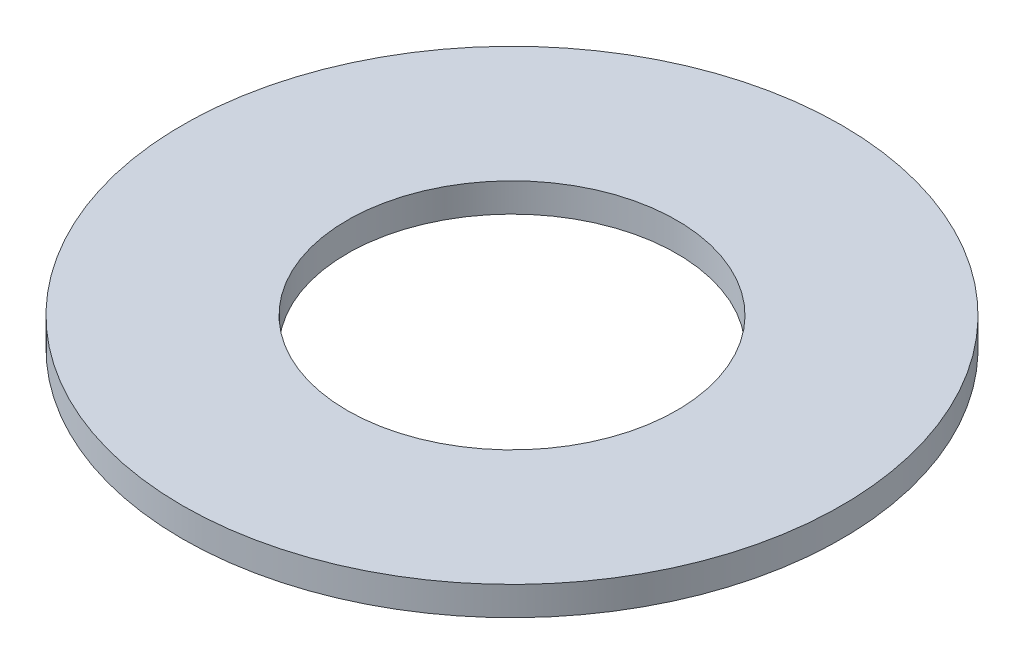
ISO-10303-21;
HEADER;
FILE_DESCRIPTION(('STEP AP214'),'2;1');
FILE_NAME('part.step','',(''),(''),'','','');
FILE_SCHEMA(('AUTOMOTIVE_DESIGN { 1 0 10303 214 1 1 1 1 }'));
ENDSEC;
DATA;
#1=APPLICATION_CONTEXT('core data for automotive mechanical design processes');
#2=APPLICATION_PROTOCOL_DEFINITION('international standard','automotive_design',2000,#1);
#3=PRODUCT_CONTEXT('',#1,'mechanical');
#4=PRODUCT('Part','Part','',(#3));
#5=PRODUCT_RELATED_PRODUCT_CATEGORY('part','',(#4));
#6=PRODUCT_DEFINITION_FORMATION('','',#4);
#7=PRODUCT_DEFINITION_CONTEXT('part definition',#1,'design');
#8=PRODUCT_DEFINITION('design','',#6,#7);
#9=PRODUCT_DEFINITION_SHAPE('','',#8);
#10=(LENGTH_UNIT() NAMED_UNIT(*) SI_UNIT(.MILLI.,.METRE.));
#11=(NAMED_UNIT(*) PLANE_ANGLE_UNIT() SI_UNIT($,.RADIAN.));
#12=(NAMED_UNIT(*) SI_UNIT($,.STERADIAN.) SOLID_ANGLE_UNIT());
#13=UNCERTAINTY_MEASURE_WITH_UNIT(LENGTH_MEASURE(1.E-05),#10,'distance_accuracy_value','');
#14=(GEOMETRIC_REPRESENTATION_CONTEXT(3) GLOBAL_UNCERTAINTY_ASSIGNED_CONTEXT((#13)) GLOBAL_UNIT_ASSIGNED_CONTEXT((#10,
#11,#12)) REPRESENTATION_CONTEXT('',''));
#15=CARTESIAN_POINT('',(0.,0.,0.));
#16=DIRECTION('',(0.,0.,1.));
#17=DIRECTION('',(1.,0.,0.));
#18=AXIS2_PLACEMENT_3D('',#15,#16,#17);
#19=CARTESIAN_POINT('',(0.,7.,0.));
#20=DIRECTION('',(0.,-1.,0.));
#21=DIRECTION('',(0.,0.,-1.));
#22=AXIS2_PLACEMENT_3D('',#19,#20,#21);
#23=CYLINDRICAL_SURFACE('',#22,80.);
#24=CARTESIAN_POINT('',(0.,7.,0.));
#25=DIRECTION('',(0.,1.,0.));
#26=DIRECTION('',(0.,0.,1.));
#27=AXIS2_PLACEMENT_3D('',#24,#25,#26);
#28=CIRCLE('',#27,80.);
#29=CARTESIAN_POINT('',(0.,7.,80.));
#30=VERTEX_POINT('',#29);
#31=EDGE_CURVE('E10',#30,#30,#28,.T.);
#32=ORIENTED_EDGE('',*,*,#31,.F.);
#33=EDGE_LOOP('',(#32));
#34=FACE_BOUND('',#33,.T.);
#35=CARTESIAN_POINT('',(0.,0.,0.));
#36=DIRECTION('',(0.,1.,0.));
#37=DIRECTION('',(0.,0.,1.));
#38=AXIS2_PLACEMENT_3D('',#35,#36,#37);
#39=CIRCLE('',#38,80.);
#40=CARTESIAN_POINT('',(0.,0.,80.));
#41=VERTEX_POINT('',#40);
#42=EDGE_CURVE('E37',#41,#41,#39,.T.);
#43=ORIENTED_EDGE('',*,*,#42,.T.);
#44=EDGE_LOOP('',(#43));
#45=FACE_BOUND('',#44,.T.);
#46=ADVANCED_FACE('F40',(#34,#45),#23,.T.);
#47=CARTESIAN_POINT('',(0.,7.,0.));
#48=DIRECTION('',(0.,1.,0.));
#49=DIRECTION('',(0.,0.,1.));
#50=AXIS2_PLACEMENT_3D('',#47,#48,#49);
#51=PLANE('',#50);
#52=CARTESIAN_POINT('',(0.,7.,0.));
#53=DIRECTION('',(0.,1.,0.));
#54=DIRECTION('',(0.,0.,1.));
#55=AXIS2_PLACEMENT_3D('',#52,#53,#54);
#56=CIRCLE('',#55,40.);
#57=CARTESIAN_POINT('',(0.,7.,40.));
#58=VERTEX_POINT('',#57);
#59=EDGE_CURVE('E50',#58,#58,#56,.T.);
#60=ORIENTED_EDGE('',*,*,#59,.F.);
#61=EDGE_LOOP('',(#60));
#62=FACE_BOUND('',#61,.T.);
#63=ORIENTED_EDGE('',*,*,#31,.T.);
#64=EDGE_LOOP('',(#63));
#65=FACE_BOUND('',#64,.T.);
#66=ADVANCED_FACE('F59',(#62,#65),#51,.T.);
#67=CARTESIAN_POINT('',(0.,0.,0.));
#68=DIRECTION('',(0.,1.,0.));
#69=DIRECTION('',(0.,0.,1.));
#70=AXIS2_PLACEMENT_3D('',#67,#68,#69);
#71=PLANE('',#70);
#72=CARTESIAN_POINT('',(0.,0.,0.));
#73=DIRECTION('',(0.,1.,0.));
#74=DIRECTION('',(0.,0.,1.));
#75=AXIS2_PLACEMENT_3D('',#72,#73,#74);
#76=CIRCLE('',#75,40.);
#77=CARTESIAN_POINT('',(0.,0.,40.));
#78=VERTEX_POINT('',#77);
#79=EDGE_CURVE('E47',#78,#78,#76,.T.);
#80=ORIENTED_EDGE('',*,*,#79,.T.);
#81=EDGE_LOOP('',(#80));
#82=FACE_BOUND('',#81,.T.);
#83=ORIENTED_EDGE('',*,*,#42,.F.);
#84=EDGE_LOOP('',(#83));
#85=FACE_BOUND('',#84,.T.);
#86=ADVANCED_FACE('F58',(#82,#85),#71,.F.);
#87=CARTESIAN_POINT('',(0.,7.,0.));
#88=DIRECTION('',(0.,-1.,0.));
#89=DIRECTION('',(0.,0.,-1.));
#90=AXIS2_PLACEMENT_3D('',#87,#88,#89);
#91=CYLINDRICAL_SURFACE('',#90,40.);
#92=ORIENTED_EDGE('',*,*,#59,.T.);
#93=EDGE_LOOP('',(#92));
#94=FACE_BOUND('',#93,.T.);
#95=ORIENTED_EDGE('',*,*,#79,.F.);
#96=EDGE_LOOP('',(#95));
#97=FACE_BOUND('',#96,.T.);
#98=ADVANCED_FACE('F54',(#94,#97),#91,.F.);
#99=CLOSED_SHELL('',(#46,#66,#86,#98));
#100=MANIFOLD_SOLID_BREP('B2',#99);
#101=ADVANCED_BREP_SHAPE_REPRESENTATION('',(#18,#100),#14);
#102=SHAPE_DEFINITION_REPRESENTATION(#9,#101);
ENDSEC;
END-ISO-10303-21;
